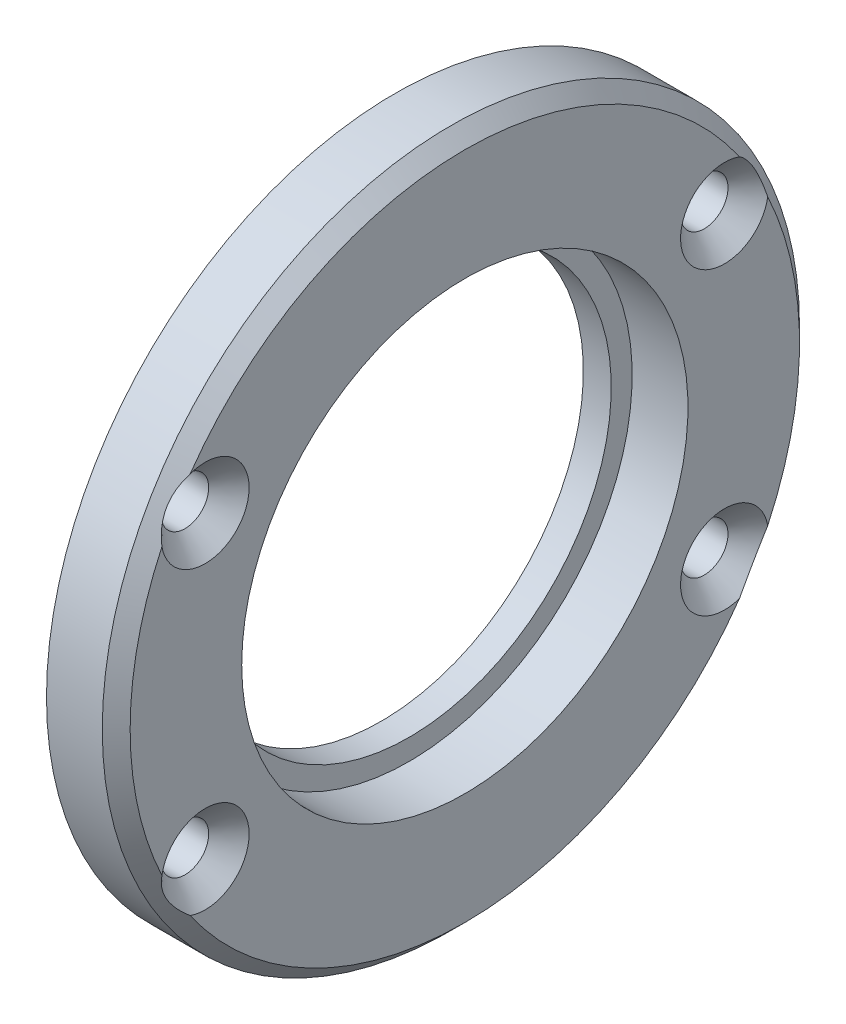
ISO-10303-21;
HEADER;
FILE_DESCRIPTION(('STEP AP214'),'2;1');
FILE_NAME('part.step','',(''),(''),'','','');
FILE_SCHEMA(('AUTOMOTIVE_DESIGN { 1 0 10303 214 1 1 1 1 }'));
ENDSEC;
DATA;
#1=APPLICATION_CONTEXT('core data for automotive mechanical design processes');
#2=APPLICATION_PROTOCOL_DEFINITION('international standard','automotive_design',2000,#1);
#3=PRODUCT_CONTEXT('',#1,'mechanical');
#4=PRODUCT('Part','Part','',(#3));
#5=PRODUCT_RELATED_PRODUCT_CATEGORY('part','',(#4));
#6=PRODUCT_DEFINITION_FORMATION('','',#4);
#7=PRODUCT_DEFINITION_CONTEXT('part definition',#1,'design');
#8=PRODUCT_DEFINITION('design','',#6,#7);
#9=PRODUCT_DEFINITION_SHAPE('','',#8);
#10=(LENGTH_UNIT() NAMED_UNIT(*) SI_UNIT(.MILLI.,.METRE.));
#11=(NAMED_UNIT(*) PLANE_ANGLE_UNIT() SI_UNIT($,.RADIAN.));
#12=(NAMED_UNIT(*) SI_UNIT($,.STERADIAN.) SOLID_ANGLE_UNIT());
#13=UNCERTAINTY_MEASURE_WITH_UNIT(LENGTH_MEASURE(1.E-05),#10,'distance_accuracy_value','');
#14=(GEOMETRIC_REPRESENTATION_CONTEXT(3) GLOBAL_UNCERTAINTY_ASSIGNED_CONTEXT((#13)) GLOBAL_UNIT_ASSIGNED_CONTEXT((#10,
#11,#12)) REPRESENTATION_CONTEXT('',''));
#15=CARTESIAN_POINT('',(0.,0.,0.));
#16=DIRECTION('',(0.,0.,1.));
#17=DIRECTION('',(1.,0.,0.));
#18=AXIS2_PLACEMENT_3D('',#15,#16,#17);
#19=CARTESIAN_POINT('',(-18.5380469099545,0.,0.));
#20=DIRECTION('',(-1.,0.,0.));
#21=DIRECTION('',(0.,0.,1.));
#22=AXIS2_PLACEMENT_3D('',#19,#20,#21);
#23=CYLINDRICAL_SURFACE('',#22,16.7);
#24=CARTESIAN_POINT('',(4.,0.,0.));
#25=DIRECTION('',(-1.,0.,0.));
#26=DIRECTION('',(0.,0.,1.));
#27=AXIS2_PLACEMENT_3D('',#24,#25,#26);
#28=CIRCLE('',#27,16.7);
#29=CARTESIAN_POINT('',(4.,0.,16.7));
#30=VERTEX_POINT('',#29);
#31=EDGE_CURVE('E182',#30,#30,#28,.T.);
#32=ORIENTED_EDGE('',*,*,#31,.F.);
#33=EDGE_LOOP('',(#32));
#34=FACE_BOUND('',#33,.T.);
#35=CARTESIAN_POINT('',(3.,0.,0.));
#36=DIRECTION('',(-1.,0.,0.));
#37=DIRECTION('',(0.,0.,1.));
#38=AXIS2_PLACEMENT_3D('',#35,#36,#37);
#39=CIRCLE('',#38,16.7);
#40=CARTESIAN_POINT('',(3.,0.,16.7));
#41=VERTEX_POINT('',#40);
#42=EDGE_CURVE('E165',#41,#41,#39,.T.);
#43=ORIENTED_EDGE('',*,*,#42,.T.);
#44=EDGE_LOOP('',(#43));
#45=FACE_BOUND('',#44,.T.);
#46=ADVANCED_FACE('F41',(#34,#45),#23,.F.);
#47=CARTESIAN_POINT('',(3.,19.,0.));
#48=DIRECTION('',(1.,0.,0.));
#49=DIRECTION('',(0.,0.,-1.));
#50=AXIS2_PLACEMENT_3D('',#47,#48,#49);
#51=PLANE('',#50);
#52=ORIENTED_EDGE('',*,*,#42,.F.);
#53=EDGE_LOOP('',(#52));
#54=FACE_BOUND('',#53,.T.);
#55=CARTESIAN_POINT('',(3.,0.,0.));
#56=DIRECTION('',(-1.,0.,0.));
#57=DIRECTION('',(0.,0.,1.));
#58=AXIS2_PLACEMENT_3D('',#55,#56,#57);
#59=CIRCLE('',#58,19.);
#60=CARTESIAN_POINT('',(3.,0.,19.));
#61=VERTEX_POINT('',#60);
#62=EDGE_CURVE('E186',#61,#61,#59,.T.);
#63=ORIENTED_EDGE('',*,*,#62,.T.);
#64=EDGE_LOOP('',(#63));
#65=FACE_BOUND('',#64,.T.);
#66=ADVANCED_FACE('F250',(#54,#65),#51,.F.);
#67=CARTESIAN_POINT('',(-18.5380469099545,0.,0.));
#68=DIRECTION('',(-1.,0.,0.));
#69=DIRECTION('',(0.,0.,1.));
#70=AXIS2_PLACEMENT_3D('',#67,#68,#69);
#71=CYLINDRICAL_SURFACE('',#70,19.);
#72=ORIENTED_EDGE('',*,*,#62,.F.);
#73=EDGE_LOOP('',(#72));
#74=FACE_BOUND('',#73,.T.);
#75=CARTESIAN_POINT('',(5.,0.,0.));
#76=DIRECTION('',(-1.,0.,0.));
#77=DIRECTION('',(0.,0.,1.));
#78=AXIS2_PLACEMENT_3D('',#75,#76,#77);
#79=CIRCLE('',#78,19.);
#80=CARTESIAN_POINT('',(5.,0.,19.));
#81=VERTEX_POINT('',#80);
#82=EDGE_CURVE('E189',#81,#81,#79,.T.);
#83=ORIENTED_EDGE('',*,*,#82,.T.);
#84=EDGE_LOOP('',(#83));
#85=FACE_BOUND('',#84,.T.);
#86=ADVANCED_FACE('F228',(#74,#85),#71,.T.);
#87=CARTESIAN_POINT('',(5.,25.,0.));
#88=DIRECTION('',(1.,0.,0.));
#89=DIRECTION('',(0.,0.,-1.));
#90=AXIS2_PLACEMENT_3D('',#87,#88,#89);
#91=PLANE('',#90);
#92=CARTESIAN_POINT('',(5.,-10.75,18.6195461813654));
#93=DIRECTION('',(1.,0.,0.));
#94=DIRECTION('',(0.,0.,-1.));
#95=AXIS2_PLACEMENT_3D('',#92,#93,#94);
#96=CIRCLE('',#95,1.69999999999999);
#97=CARTESIAN_POINT('',(5.,-10.75,16.9195461813654));
#98=VERTEX_POINT('',#97);
#99=EDGE_CURVE('E166',#98,#98,#96,.T.);
#100=ORIENTED_EDGE('',*,*,#99,.T.);
#101=EDGE_LOOP('',(#100));
#102=FACE_BOUND('',#101,.T.);
#103=CARTESIAN_POINT('',(5.,10.75,18.6195461813654));
#104=DIRECTION('',(1.,0.,0.));
#105=DIRECTION('',(0.,0.,-1.));
#106=AXIS2_PLACEMENT_3D('',#103,#104,#105);
#107=CIRCLE('',#106,1.69999999999999);
#108=CARTESIAN_POINT('',(5.,10.75,16.9195461813654));
#109=VERTEX_POINT('',#108);
#110=EDGE_CURVE('E169',#109,#109,#107,.T.);
#111=ORIENTED_EDGE('',*,*,#110,.T.);
#112=EDGE_LOOP('',(#111));
#113=FACE_BOUND('',#112,.T.);
#114=CARTESIAN_POINT('',(5.,-10.75,-18.6195461813654));
#115=DIRECTION('',(1.,0.,0.));
#116=DIRECTION('',(0.,0.,-1.));
#117=AXIS2_PLACEMENT_3D('',#114,#115,#116);
#118=CIRCLE('',#117,1.69999999999999);
#119=CARTESIAN_POINT('',(5.,-10.75,-20.3195461813654));
#120=VERTEX_POINT('',#119);
#121=EDGE_CURVE('E174',#120,#120,#118,.T.);
#122=ORIENTED_EDGE('',*,*,#121,.T.);
#123=EDGE_LOOP('',(#122));
#124=FACE_BOUND('',#123,.T.);
#125=CARTESIAN_POINT('',(5.,10.75,-18.6195461813654));
#126=DIRECTION('',(1.,0.,0.));
#127=DIRECTION('',(0.,0.,-1.));
#128=AXIS2_PLACEMENT_3D('',#125,#126,#127);
#129=CIRCLE('',#128,1.69999999999999);
#130=CARTESIAN_POINT('',(5.,10.75,-20.3195461813654));
#131=VERTEX_POINT('',#130);
#132=EDGE_CURVE('E179',#131,#131,#129,.T.);
#133=ORIENTED_EDGE('',*,*,#132,.T.);
#134=EDGE_LOOP('',(#133));
#135=FACE_BOUND('',#134,.T.);
#136=ORIENTED_EDGE('',*,*,#82,.F.);
#137=EDGE_LOOP('',(#136));
#138=FACE_BOUND('',#137,.T.);
#139=CARTESIAN_POINT('',(5.,0.,0.));
#140=DIRECTION('',(-1.,0.,0.));
#141=DIRECTION('',(0.,0.,1.));
#142=AXIS2_PLACEMENT_3D('',#139,#140,#141);
#143=CIRCLE('',#142,25.);
#144=CARTESIAN_POINT('',(5.,0.,25.));
#145=VERTEX_POINT('',#144);
#146=EDGE_CURVE('E192',#145,#145,#143,.T.);
#147=ORIENTED_EDGE('',*,*,#146,.T.);
#148=EDGE_LOOP('',(#147));
#149=FACE_BOUND('',#148,.T.);
#150=ADVANCED_FACE('F224',(#102,#113,#124,#135,#138,#149),#91,.F.);
#151=CARTESIAN_POINT('',(-18.5380469099545,0.,0.));
#152=DIRECTION('',(-1.,0.,0.));
#153=DIRECTION('',(0.,0.,1.));
#154=AXIS2_PLACEMENT_3D('',#151,#152,#153);
#155=CYLINDRICAL_SURFACE('',#154,25.);
#156=CARTESIAN_POINT('',(8.99999999999999,0.,0.));
#157=DIRECTION('',(-1.,0.,0.));
#158=DIRECTION('',(0.,0.,1.));
#159=AXIS2_PLACEMENT_3D('',#156,#157,#158);
#160=CIRCLE('',#159,25.);
#161=CARTESIAN_POINT('',(8.99999999999999,0.,25.));
#162=VERTEX_POINT('',#161);
#163=EDGE_CURVE('E162',#162,#162,#160,.T.);
#164=ORIENTED_EDGE('',*,*,#163,.T.);
#165=EDGE_LOOP('',(#164));
#166=FACE_BOUND('',#165,.T.);
#167=ORIENTED_EDGE('',*,*,#146,.F.);
#168=EDGE_LOOP('',(#167));
#169=FACE_BOUND('',#168,.T.);
#170=ADVANCED_FACE('F227',(#166,#169),#155,.T.);
#171=CARTESIAN_POINT('',(10.,16.,0.));
#172=DIRECTION('',(-1.,0.,0.));
#173=DIRECTION('',(0.,0.,1.));
#174=AXIS2_PLACEMENT_3D('',#171,#172,#173);
#175=PLANE('',#174);
#176=CARTESIAN_POINT('',(10.,-10.75,-18.6195461813654));
#177=DIRECTION('',(1.,0.,0.));
#178=DIRECTION('',(0.,0.,-1.));
#179=AXIS2_PLACEMENT_3D('',#176,#177,#178);
#180=CIRCLE('',#179,3.15);
#181=CARTESIAN_POINT('',(10.,-10.2053888659361,-21.7221094301411));
#182=VERTEX_POINT('',#181);
#183=CARTESIAN_POINT('',(10.,-13.7092041573197,-19.6991807284701));
#184=VERTEX_POINT('',#183);
#185=EDGE_CURVE('E172',#182,#184,#180,.T.);
#186=ORIENTED_EDGE('',*,*,#185,.F.);
#187=CARTESIAN_POINT('',(10.,0.,0.));
#188=DIRECTION('',(-1.,0.,0.));
#189=DIRECTION('',(0.,0.,1.));
#190=AXIS2_PLACEMENT_3D('',#187,#188,#189);
#191=CIRCLE('',#190,24.);
#192=CARTESIAN_POINT('',(10.,10.2053888659361,-21.7221094301411));
#193=VERTEX_POINT('',#192);
#194=EDGE_CURVE('E158',#182,#193,#191,.F.);
#195=ORIENTED_EDGE('',*,*,#194,.T.);
#196=CARTESIAN_POINT('',(10.,10.75,-18.6195461813654));
#197=DIRECTION('',(1.,0.,0.));
#198=DIRECTION('',(0.,0.,-1.));
#199=AXIS2_PLACEMENT_3D('',#196,#197,#198);
#200=CIRCLE('',#199,3.15);
#201=CARTESIAN_POINT('',(10.,13.7092041573197,-19.6991807284701));
#202=VERTEX_POINT('',#201);
#203=EDGE_CURVE('E177',#202,#193,#200,.T.);
#204=ORIENTED_EDGE('',*,*,#203,.F.);
#205=CARTESIAN_POINT('',(10.,0.,0.));
#206=DIRECTION('',(-1.,0.,0.));
#207=DIRECTION('',(0.,0.,1.));
#208=AXIS2_PLACEMENT_3D('',#205,#206,#207);
#209=CIRCLE('',#208,24.);
#210=CARTESIAN_POINT('',(10.,13.7092041573197,19.6991807284701));
#211=VERTEX_POINT('',#210);
#212=EDGE_CURVE('E100',#202,#211,#209,.F.);
#213=ORIENTED_EDGE('',*,*,#212,.T.);
#214=CARTESIAN_POINT('',(10.,10.75,18.6195461813654));
#215=DIRECTION('',(1.,0.,0.));
#216=DIRECTION('',(0.,0.,-1.));
#217=AXIS2_PLACEMENT_3D('',#214,#215,#216);
#218=CIRCLE('',#217,3.15);
#219=CARTESIAN_POINT('',(10.,10.2053888659361,21.7221094301411));
#220=VERTEX_POINT('',#219);
#221=EDGE_CURVE('E97',#220,#211,#218,.T.);
#222=ORIENTED_EDGE('',*,*,#221,.F.);
#223=CARTESIAN_POINT('',(10.,0.,0.));
#224=DIRECTION('',(-1.,0.,0.));
#225=DIRECTION('',(0.,0.,1.));
#226=AXIS2_PLACEMENT_3D('',#223,#224,#225);
#227=CIRCLE('',#226,24.);
#228=CARTESIAN_POINT('',(10.,-10.2053888659361,21.7221094301411));
#229=VERTEX_POINT('',#228);
#230=EDGE_CURVE('E89',#220,#229,#227,.F.);
#231=ORIENTED_EDGE('',*,*,#230,.T.);
#232=CARTESIAN_POINT('',(10.,-10.75,18.6195461813654));
#233=DIRECTION('',(1.,0.,0.));
#234=DIRECTION('',(0.,0.,-1.));
#235=AXIS2_PLACEMENT_3D('',#232,#233,#234);
#236=CIRCLE('',#235,3.15);
#237=CARTESIAN_POINT('',(10.,-13.7092041573197,19.6991807284701));
#238=VERTEX_POINT('',#237);
#239=EDGE_CURVE('E94',#238,#229,#236,.T.);
#240=ORIENTED_EDGE('',*,*,#239,.F.);
#241=CARTESIAN_POINT('',(10.,0.,0.));
#242=DIRECTION('',(-1.,0.,0.));
#243=DIRECTION('',(0.,0.,1.));
#244=AXIS2_PLACEMENT_3D('',#241,#242,#243);
#245=CIRCLE('',#244,24.);
#246=EDGE_CURVE('E101',#238,#184,#245,.F.);
#247=ORIENTED_EDGE('',*,*,#246,.T.);
#248=EDGE_LOOP('',(#186,#195,#204,#213,#222,#231,#240,#247));
#249=FACE_BOUND('',#248,.T.);
#250=CARTESIAN_POINT('',(10.,0.,0.));
#251=DIRECTION('',(-1.,0.,0.));
#252=DIRECTION('',(0.,0.,1.));
#253=AXIS2_PLACEMENT_3D('',#250,#251,#252);
#254=CIRCLE('',#253,16.);
#255=CARTESIAN_POINT('',(10.,0.,16.));
#256=VERTEX_POINT('',#255);
#257=EDGE_CURVE('E195',#256,#256,#254,.T.);
#258=ORIENTED_EDGE('',*,*,#257,.T.);
#259=EDGE_LOOP('',(#258));
#260=FACE_BOUND('',#259,.T.);
#261=ADVANCED_FACE('F92',(#249,#260),#175,.F.);
#262=CARTESIAN_POINT('',(-18.5380469099545,0.,0.));
#263=DIRECTION('',(-1.,0.,0.));
#264=DIRECTION('',(0.,0.,1.));
#265=AXIS2_PLACEMENT_3D('',#262,#263,#264);
#266=CYLINDRICAL_SURFACE('',#265,16.);
#267=ORIENTED_EDGE('',*,*,#257,.F.);
#268=EDGE_LOOP('',(#267));
#269=FACE_BOUND('',#268,.T.);
#270=CARTESIAN_POINT('',(6.,0.,0.));
#271=DIRECTION('',(-1.,0.,0.));
#272=DIRECTION('',(0.,0.,1.));
#273=AXIS2_PLACEMENT_3D('',#270,#271,#272);
#274=CIRCLE('',#273,16.);
#275=CARTESIAN_POINT('',(6.,0.,16.));
#276=VERTEX_POINT('',#275);
#277=EDGE_CURVE('E198',#276,#276,#274,.T.);
#278=ORIENTED_EDGE('',*,*,#277,.T.);
#279=EDGE_LOOP('',(#278));
#280=FACE_BOUND('',#279,.T.);
#281=ADVANCED_FACE('F247',(#269,#280),#266,.F.);
#282=CARTESIAN_POINT('',(6.,14.5,0.));
#283=DIRECTION('',(-1.,0.,0.));
#284=DIRECTION('',(0.,0.,1.));
#285=AXIS2_PLACEMENT_3D('',#282,#283,#284);
#286=PLANE('',#285);
#287=ORIENTED_EDGE('',*,*,#277,.F.);
#288=EDGE_LOOP('',(#287));
#289=FACE_BOUND('',#288,.T.);
#290=CARTESIAN_POINT('',(6.,0.,0.));
#291=DIRECTION('',(-1.,0.,0.));
#292=DIRECTION('',(0.,0.,1.));
#293=AXIS2_PLACEMENT_3D('',#290,#291,#292);
#294=CIRCLE('',#293,14.5);
#295=CARTESIAN_POINT('',(6.,0.,14.5));
#296=VERTEX_POINT('',#295);
#297=EDGE_CURVE('E201',#296,#296,#294,.T.);
#298=ORIENTED_EDGE('',*,*,#297,.T.);
#299=EDGE_LOOP('',(#298));
#300=FACE_BOUND('',#299,.T.);
#301=ADVANCED_FACE('F325',(#289,#300),#286,.F.);
#302=CARTESIAN_POINT('',(-18.5380469099545,0.,0.));
#303=DIRECTION('',(-1.,0.,0.));
#304=DIRECTION('',(0.,0.,1.));
#305=AXIS2_PLACEMENT_3D('',#302,#303,#304);
#306=CYLINDRICAL_SURFACE('',#305,14.5);
#307=ORIENTED_EDGE('',*,*,#297,.F.);
#308=EDGE_LOOP('',(#307));
#309=FACE_BOUND('',#308,.T.);
#310=CARTESIAN_POINT('',(4.,0.,0.));
#311=DIRECTION('',(-1.,0.,0.));
#312=DIRECTION('',(0.,0.,1.));
#313=AXIS2_PLACEMENT_3D('',#310,#311,#312);
#314=CIRCLE('',#313,14.5);
#315=CARTESIAN_POINT('',(4.,0.,14.5));
#316=VERTEX_POINT('',#315);
#317=EDGE_CURVE('E204',#316,#316,#314,.T.);
#318=ORIENTED_EDGE('',*,*,#317,.T.);
#319=EDGE_LOOP('',(#318));
#320=FACE_BOUND('',#319,.T.);
#321=ADVANCED_FACE('F318',(#309,#320),#306,.F.);
#322=CARTESIAN_POINT('',(4.,16.7,0.));
#323=DIRECTION('',(1.,0.,0.));
#324=DIRECTION('',(0.,0.,-1.));
#325=AXIS2_PLACEMENT_3D('',#322,#323,#324);
#326=PLANE('',#325);
#327=ORIENTED_EDGE('',*,*,#317,.F.);
#328=EDGE_LOOP('',(#327));
#329=FACE_BOUND('',#328,.T.);
#330=ORIENTED_EDGE('',*,*,#31,.T.);
#331=EDGE_LOOP('',(#330));
#332=FACE_BOUND('',#331,.T.);
#333=ADVANCED_FACE('F306',(#329,#332),#326,.F.);
#334=CARTESIAN_POINT('',(10.,10.75,-18.6195461813654));
#335=DIRECTION('',(1.,0.,0.));
#336=DIRECTION('',(0.,0.,-1.));
#337=AXIS2_PLACEMENT_3D('',#334,#335,#336);
#338=CYLINDRICAL_SURFACE('',#337,1.69999999999999);
#339=CARTESIAN_POINT('',(8.55,10.75,-18.6195461813654));
#340=DIRECTION('',(1.,0.,0.));
#341=DIRECTION('',(0.,0.,-1.));
#342=AXIS2_PLACEMENT_3D('',#339,#340,#341);
#343=CIRCLE('',#342,1.7);
#344=CARTESIAN_POINT('',(8.55,10.75,-20.3195461813654));
#345=VERTEX_POINT('',#344);
#346=EDGE_CURVE('E183',#345,#345,#343,.T.);
#347=ORIENTED_EDGE('',*,*,#346,.T.);
#348=EDGE_LOOP('',(#347));
#349=FACE_BOUND('',#348,.T.);
#350=ORIENTED_EDGE('',*,*,#132,.F.);
#351=EDGE_LOOP('',(#350));
#352=FACE_BOUND('',#351,.T.);
#353=ADVANCED_FACE('F150',(#349,#352),#338,.F.);
#354=CARTESIAN_POINT('',(10.,10.75,-18.6195461813654));
#355=DIRECTION('',(1.,0.,0.));
#356=DIRECTION('',(0.,0.,-1.));
#357=AXIS2_PLACEMENT_3D('',#354,#355,#356);
#358=CONICAL_SURFACE('',#357,3.15,0.785398163397448);
#359=ORIENTED_EDGE('',*,*,#346,.F.);
#360=EDGE_LOOP('',(#359));
#361=FACE_BOUND('',#360,.T.);
#362=ORIENTED_EDGE('',*,*,#203,.T.);
#363=CARTESIAN_POINT('',(10.,10.2053888659361,-21.7221094301411));
#364=CARTESIAN_POINT('',(9.96137893093603,10.3322220353334,-21.7051973885753));
#365=CARTESIAN_POINT('',(9.92558434170605,10.4594197389709,-21.6839534650089));
#366=CARTESIAN_POINT('',(9.86032695773192,10.7137540384085,-21.6322682231893));
#367=CARTESIAN_POINT('',(9.83087303307783,10.8408903035271,-21.6018141619765));
#368=CARTESIAN_POINT('',(9.7791817526919,11.0934916227394,-21.5313481093338));
#369=CARTESIAN_POINT('',(9.75691844228903,11.2189610836803,-21.4913714192849));
#370=CARTESIAN_POINT('',(9.72009811546861,11.4674380157169,-21.401602574799));
#371=CARTESIAN_POINT('',(9.70553685266528,11.5904468073868,-21.3518158497749));
#372=CARTESIAN_POINT('',(9.6850469203442,11.8271265560754,-21.2450460275224));
#373=CARTESIAN_POINT('',(9.67874727508782,11.9409654421574,-21.1885069128577));
#374=CARTESIAN_POINT('',(9.67373692314066,12.1642068135913,-21.0669242671037));
#375=CARTESIAN_POINT('',(9.6750273336381,12.2736086434619,-21.0018794854342));
#376=CARTESIAN_POINT('',(9.68516105290433,12.4869289732004,-20.8639425025584));
#377=CARTESIAN_POINT('',(9.69400191305707,12.5908492391439,-20.7910528521454));
#378=CARTESIAN_POINT('',(9.71895932457139,12.79241793267,-20.6382855854083));
#379=CARTESIAN_POINT('',(9.7350743495482,12.89006767113,-20.5584094379395));
#380=CARTESIAN_POINT('',(9.78263946636469,13.1195338436508,-20.3565702395189));
#381=CARTESIAN_POINT('',(9.81770919876945,13.2478012953969,-20.231378233314));
#382=CARTESIAN_POINT('',(9.87952402815491,13.429087565992,-20.0365775657071));
#383=CARTESIAN_POINT('',(9.90165326096098,13.4876425207478,-19.9705032144689));
#384=CARTESIAN_POINT('',(9.94875211098999,13.6011235726555,-19.8363079412898));
#385=CARTESIAN_POINT('',(9.9737210612539,13.6560505171403,-19.7681875026643));
#386=CARTESIAN_POINT('',(10.,13.7092041573197,-19.6991807284701));
#387=B_SPLINE_CURVE_WITH_KNOTS('',3,(#363,#364,#365,#366,#367,#368,#369,#370,#371,#372,#373,
#374,#375,#376,#377,#378,#379,#380,#381,#382,#383,#384,#385,#386),.UNSPECIFIED.,.F.,.F.,(4,2,2,
2,2,2,2,2,2,2,2,4),(0.,0.400988493408088,0.802534344423923,1.20261417488833,1.60247319799273,
1.98368133675945,2.36494558735325,2.74608624061704,3.12714695383895,3.67347055589679,
3.94641290646711,4.21929128346105),.UNSPECIFIED.);
#388=EDGE_CURVE('E63',#193,#202,#387,.T.);
#389=ORIENTED_EDGE('',*,*,#388,.T.);
#390=EDGE_LOOP('',(#362,#389));
#391=FACE_BOUND('',#390,.T.);
#392=ADVANCED_FACE('F145',(#361,#391),#358,.F.);
#393=CARTESIAN_POINT('',(10.,-10.75,-18.6195461813654));
#394=DIRECTION('',(1.,0.,0.));
#395=DIRECTION('',(0.,0.,-1.));
#396=AXIS2_PLACEMENT_3D('',#393,#394,#395);
#397=CYLINDRICAL_SURFACE('',#396,1.69999999999999);
#398=CARTESIAN_POINT('',(8.55,-10.75,-18.6195461813654));
#399=DIRECTION('',(1.,0.,0.));
#400=DIRECTION('',(0.,0.,-1.));
#401=AXIS2_PLACEMENT_3D('',#398,#399,#400);
#402=CIRCLE('',#401,1.7);
#403=CARTESIAN_POINT('',(8.55,-10.75,-20.3195461813654));
#404=VERTEX_POINT('',#403);
#405=EDGE_CURVE('E178',#404,#404,#402,.T.);
#406=ORIENTED_EDGE('',*,*,#405,.T.);
#407=EDGE_LOOP('',(#406));
#408=FACE_BOUND('',#407,.T.);
#409=ORIENTED_EDGE('',*,*,#121,.F.);
#410=EDGE_LOOP('',(#409));
#411=FACE_BOUND('',#410,.T.);
#412=ADVANCED_FACE('F141',(#408,#411),#397,.F.);
#413=CARTESIAN_POINT('',(10.,-10.75,-18.6195461813654));
#414=DIRECTION('',(1.,0.,0.));
#415=DIRECTION('',(0.,0.,-1.));
#416=AXIS2_PLACEMENT_3D('',#413,#414,#415);
#417=CONICAL_SURFACE('',#416,3.15,0.785398163397448);
#418=ORIENTED_EDGE('',*,*,#405,.F.);
#419=EDGE_LOOP('',(#418));
#420=FACE_BOUND('',#419,.T.);
#421=ORIENTED_EDGE('',*,*,#185,.T.);
#422=CARTESIAN_POINT('',(10.,-13.7092041573197,-19.6991807284701));
#423=CARTESIAN_POINT('',(9.96137893093603,-13.6311413149952,-19.8005654544277));
#424=CARTESIAN_POINT('',(9.92558434170605,-13.5491446856919,-19.9000999352976));
#425=CARTESIAN_POINT('',(9.86032695773192,-13.3772168035565,-20.0945172787545));
#426=CARTESIAN_POINT('',(9.83087303307783,-13.2872746803386,-20.1893934834831));
#427=CARTESIAN_POINT('',(9.7791817526919,-13.0999486290394,-20.372919616629));
#428=CARTESIAN_POINT('',(9.75691844228904,-13.0025930694274,-20.4615910121785));
#429=CARTESIAN_POINT('',(9.72009811546861,-12.800612503616,-20.6318939253337));
#430=CARTESIAN_POINT('',(9.70553685266528,-12.6959915391389,-20.7135293012966));
#431=CARTESIAN_POINT('',(9.6850469203442,-12.4851862863664,-20.865115065096));
#432=CARTESIAN_POINT('',(9.67874727508782,-12.3793025337183,-20.9354328750492));
#433=CARTESIAN_POINT('',(9.67373692314066,-12.1623881881191,-21.0679742510096));
#434=CARTESIAN_POINT('',(9.6750273336381,-12.0513568398744,-21.1301966240633));
#435=CARTESIAN_POINT('',(9.68516105290433,-11.8252397437133,-21.2459689573227));
#436=CARTESIAN_POINT('',(9.69400191305707,-11.7101553218109,-21.2995217223912));
#437=CARTESIAN_POINT('',(9.71895932457139,-11.4770706411869,-21.397701698224));
#438=CARTESIAN_POINT('',(9.7350743495482,-11.3590709990924,-21.4423307786688));
#439=CARTESIAN_POINT('',(9.78263946636469,-11.0695400395203,-21.5401347141707));
#440=CARTESIAN_POINT('',(9.81770919876945,-10.8969868559231,-21.5886215827591));
#441=CARTESIAN_POINT('',(9.87952402815491,-10.6376413938038,-21.6482197646484));
#442=CARTESIAN_POINT('',(9.90165326096098,-10.551141849715,-21.6658926673652));
#443=CARTESIAN_POINT('',(9.94875211098999,-10.3781848081203,-21.6970725045759));
#444=CARTESIAN_POINT('',(9.9737210612539,-10.2917273055113,-21.7105804145392));
#445=CARTESIAN_POINT('',(10.,-10.2053888659361,-21.7221094301411));
#446=B_SPLINE_CURVE_WITH_KNOTS('',3,(#422,#423,#424,#425,#426,#427,#428,#429,#430,#431,#432,
#433,#434,#435,#436,#437,#438,#439,#440,#441,#442,#443,#444,#445),.UNSPECIFIED.,.F.,.F.,(4,2,2,
2,2,2,2,2,2,2,2,4),(0.,0.400988493408088,0.802534344423924,1.20261417488832,1.60247319799273,
1.98368133675945,2.36494558735325,2.74608624061705,3.12714695383896,3.67347055589679,
3.94641290646711,4.21929128346105),.UNSPECIFIED.);
#447=EDGE_CURVE('E11',#184,#182,#446,.T.);
#448=ORIENTED_EDGE('',*,*,#447,.T.);
#449=EDGE_LOOP('',(#421,#448));
#450=FACE_BOUND('',#449,.T.);
#451=ADVANCED_FACE('F136',(#420,#450),#417,.F.);
#452=CARTESIAN_POINT('',(10.,10.75,18.6195461813654));
#453=DIRECTION('',(1.,0.,0.));
#454=DIRECTION('',(0.,0.,-1.));
#455=AXIS2_PLACEMENT_3D('',#452,#453,#454);
#456=CYLINDRICAL_SURFACE('',#455,1.69999999999999);
#457=CARTESIAN_POINT('',(8.55,10.75,18.6195461813654));
#458=DIRECTION('',(1.,0.,0.));
#459=DIRECTION('',(0.,0.,-1.));
#460=AXIS2_PLACEMENT_3D('',#457,#458,#459);
#461=CIRCLE('',#460,1.7);
#462=CARTESIAN_POINT('',(8.55,10.75,16.9195461813654));
#463=VERTEX_POINT('',#462);
#464=EDGE_CURVE('E173',#463,#463,#461,.T.);
#465=ORIENTED_EDGE('',*,*,#464,.T.);
#466=EDGE_LOOP('',(#465));
#467=FACE_BOUND('',#466,.T.);
#468=ORIENTED_EDGE('',*,*,#110,.F.);
#469=EDGE_LOOP('',(#468));
#470=FACE_BOUND('',#469,.T.);
#471=ADVANCED_FACE('F133',(#467,#470),#456,.F.);
#472=CARTESIAN_POINT('',(10.,10.75,18.6195461813654));
#473=DIRECTION('',(1.,0.,0.));
#474=DIRECTION('',(0.,0.,-1.));
#475=AXIS2_PLACEMENT_3D('',#472,#473,#474);
#476=CONICAL_SURFACE('',#475,3.15,0.785398163397448);
#477=ORIENTED_EDGE('',*,*,#464,.F.);
#478=EDGE_LOOP('',(#477));
#479=FACE_BOUND('',#478,.T.);
#480=ORIENTED_EDGE('',*,*,#221,.T.);
#481=CARTESIAN_POINT('',(10.,13.7092041573197,19.6991807284701));
#482=CARTESIAN_POINT('',(9.96137893093603,13.6311413149952,19.8005654544277));
#483=CARTESIAN_POINT('',(9.92558434170605,13.5491446856919,19.9000999352976));
#484=CARTESIAN_POINT('',(9.86032695773192,13.3772168035565,20.0945172787545));
#485=CARTESIAN_POINT('',(9.83087303307783,13.2872746803386,20.1893934834831));
#486=CARTESIAN_POINT('',(9.7791817526919,13.0999486290394,20.372919616629));
#487=CARTESIAN_POINT('',(9.75691844228904,13.0025930694274,20.4615910121785));
#488=CARTESIAN_POINT('',(9.72009811546861,12.800612503616,20.6318939253337));
#489=CARTESIAN_POINT('',(9.70553685266528,12.6959915391389,20.7135293012966));
#490=CARTESIAN_POINT('',(9.6850469203442,12.4851862863664,20.865115065096));
#491=CARTESIAN_POINT('',(9.67874727508782,12.3793025337183,20.9354328750492));
#492=CARTESIAN_POINT('',(9.67373692314066,12.1623881881191,21.0679742510096));
#493=CARTESIAN_POINT('',(9.6750273336381,12.0513568398744,21.1301966240633));
#494=CARTESIAN_POINT('',(9.68516105290433,11.8252397437133,21.2459689573227));
#495=CARTESIAN_POINT('',(9.69400191305707,11.7101553218109,21.2995217223912));
#496=CARTESIAN_POINT('',(9.71895932457139,11.4770706411869,21.397701698224));
#497=CARTESIAN_POINT('',(9.7350743495482,11.3590709990924,21.4423307786688));
#498=CARTESIAN_POINT('',(9.78263946636469,11.0695400395203,21.5401347141707));
#499=CARTESIAN_POINT('',(9.81770919876945,10.8969868559231,21.5886215827591));
#500=CARTESIAN_POINT('',(9.87952402815491,10.6376413938038,21.6482197646484));
#501=CARTESIAN_POINT('',(9.90165326096098,10.551141849715,21.6658926673652));
#502=CARTESIAN_POINT('',(9.94875211098999,10.3781848081203,21.6970725045759));
#503=CARTESIAN_POINT('',(9.9737210612539,10.2917273055113,21.7105804145392));
#504=CARTESIAN_POINT('',(10.,10.2053888659361,21.7221094301411));
#505=B_SPLINE_CURVE_WITH_KNOTS('',3,(#481,#482,#483,#484,#485,#486,#487,#488,#489,#490,#491,
#492,#493,#494,#495,#496,#497,#498,#499,#500,#501,#502,#503,#504),.UNSPECIFIED.,.F.,.F.,(4,2,2,
2,2,2,2,2,2,2,2,4),(0.,0.400988493408088,0.802534344423924,1.20261417488832,1.60247319799273,
1.98368133675945,2.36494558735325,2.74608624061705,3.12714695383896,3.67347055589679,
3.94641290646711,4.21929128346105),.UNSPECIFIED.);
#506=EDGE_CURVE('E109',#211,#220,#505,.T.);
#507=ORIENTED_EDGE('',*,*,#506,.T.);
#508=EDGE_LOOP('',(#480,#507));
#509=FACE_BOUND('',#508,.T.);
#510=ADVANCED_FACE('F128',(#479,#509),#476,.F.);
#511=CARTESIAN_POINT('',(10.,-10.75,18.6195461813654));
#512=DIRECTION('',(1.,0.,0.));
#513=DIRECTION('',(0.,0.,-1.));
#514=AXIS2_PLACEMENT_3D('',#511,#512,#513);
#515=CYLINDRICAL_SURFACE('',#514,1.69999999999999);
#516=CARTESIAN_POINT('',(8.55,-10.75,18.6195461813654));
#517=DIRECTION('',(1.,0.,0.));
#518=DIRECTION('',(0.,0.,-1.));
#519=AXIS2_PLACEMENT_3D('',#516,#517,#518);
#520=CIRCLE('',#519,1.7);
#521=CARTESIAN_POINT('',(8.55,-10.75,16.9195461813654));
#522=VERTEX_POINT('',#521);
#523=EDGE_CURVE('E105',#522,#522,#520,.T.);
#524=ORIENTED_EDGE('',*,*,#523,.T.);
#525=EDGE_LOOP('',(#524));
#526=FACE_BOUND('',#525,.T.);
#527=ORIENTED_EDGE('',*,*,#99,.F.);
#528=EDGE_LOOP('',(#527));
#529=FACE_BOUND('',#528,.T.);
#530=ADVANCED_FACE('F125',(#526,#529),#515,.F.);
#531=CARTESIAN_POINT('',(10.,-10.75,18.6195461813654));
#532=DIRECTION('',(1.,0.,0.));
#533=DIRECTION('',(0.,0.,-1.));
#534=AXIS2_PLACEMENT_3D('',#531,#532,#533);
#535=CONICAL_SURFACE('',#534,3.15,0.785398163397448);
#536=ORIENTED_EDGE('',*,*,#523,.F.);
#537=EDGE_LOOP('',(#536));
#538=FACE_BOUND('',#537,.T.);
#539=ORIENTED_EDGE('',*,*,#239,.T.);
#540=CARTESIAN_POINT('',(10.,-10.2053888659361,21.7221094301411));
#541=CARTESIAN_POINT('',(9.96137893093603,-10.3322220353334,21.7051973885753));
#542=CARTESIAN_POINT('',(9.92558434170605,-10.4594197389709,21.6839534650089));
#543=CARTESIAN_POINT('',(9.86032695773192,-10.7137540384085,21.6322682231893));
#544=CARTESIAN_POINT('',(9.83087303307783,-10.8408903035271,21.6018141619765));
#545=CARTESIAN_POINT('',(9.7791817526919,-11.0934916227394,21.5313481093338));
#546=CARTESIAN_POINT('',(9.75691844228903,-11.2189610836803,21.4913714192849));
#547=CARTESIAN_POINT('',(9.72009811546861,-11.4674380157169,21.401602574799));
#548=CARTESIAN_POINT('',(9.70553685266528,-11.5904468073868,21.3518158497749));
#549=CARTESIAN_POINT('',(9.6850469203442,-11.8271265560754,21.2450460275224));
#550=CARTESIAN_POINT('',(9.67874727508782,-11.9409654421574,21.1885069128577));
#551=CARTESIAN_POINT('',(9.67373692314066,-12.1642068135913,21.0669242671037));
#552=CARTESIAN_POINT('',(9.6750273336381,-12.2736086434619,21.0018794854342));
#553=CARTESIAN_POINT('',(9.68516105290433,-12.4869289732004,20.8639425025584));
#554=CARTESIAN_POINT('',(9.69400191305707,-12.5908492391439,20.7910528521454));
#555=CARTESIAN_POINT('',(9.71895932457139,-12.79241793267,20.6382855854083));
#556=CARTESIAN_POINT('',(9.7350743495482,-12.89006767113,20.5584094379395));
#557=CARTESIAN_POINT('',(9.78263946636469,-13.1195338436508,20.3565702395189));
#558=CARTESIAN_POINT('',(9.81770919876945,-13.2478012953969,20.231378233314));
#559=CARTESIAN_POINT('',(9.87952402815491,-13.429087565992,20.0365775657071));
#560=CARTESIAN_POINT('',(9.90165326096098,-13.4876425207478,19.9705032144689));
#561=CARTESIAN_POINT('',(9.94875211098999,-13.6011235726555,19.8363079412898));
#562=CARTESIAN_POINT('',(9.9737210612539,-13.6560505171403,19.7681875026643));
#563=CARTESIAN_POINT('',(10.,-13.7092041573197,19.6991807284701));
#564=B_SPLINE_CURVE_WITH_KNOTS('',3,(#540,#541,#542,#543,#544,#545,#546,#547,#548,#549,#550,
#551,#552,#553,#554,#555,#556,#557,#558,#559,#560,#561,#562,#563),.UNSPECIFIED.,.F.,.F.,(4,2,2,
2,2,2,2,2,2,2,2,4),(0.,0.400988493408088,0.802534344423923,1.20261417488833,1.60247319799273,
1.98368133675945,2.36494558735325,2.74608624061704,3.12714695383895,3.67347055589679,
3.94641290646711,4.21929128346105),.UNSPECIFIED.);
#565=EDGE_CURVE('E56',#229,#238,#564,.T.);
#566=ORIENTED_EDGE('',*,*,#565,.T.);
#567=EDGE_LOOP('',(#539,#566));
#568=FACE_BOUND('',#567,.T.);
#569=ADVANCED_FACE('F104',(#538,#568),#535,.F.);
#570=CARTESIAN_POINT('',(8.99999999999999,0.,0.));
#571=DIRECTION('',(-1.,0.,0.));
#572=DIRECTION('',(0.,0.,1.));
#573=AXIS2_PLACEMENT_3D('',#570,#571,#572);
#574=CONICAL_SURFACE('',#573,25.,0.785398163397452);
#575=ORIENTED_EDGE('',*,*,#388,.F.);
#576=ORIENTED_EDGE('',*,*,#194,.F.);
#577=ORIENTED_EDGE('',*,*,#447,.F.);
#578=ORIENTED_EDGE('',*,*,#246,.F.);
#579=ORIENTED_EDGE('',*,*,#565,.F.);
#580=ORIENTED_EDGE('',*,*,#230,.F.);
#581=ORIENTED_EDGE('',*,*,#506,.F.);
#582=ORIENTED_EDGE('',*,*,#212,.F.);
#583=EDGE_LOOP('',(#575,#576,#577,#578,#579,#580,#581,#582));
#584=FACE_BOUND('',#583,.T.);
#585=ORIENTED_EDGE('',*,*,#163,.F.);
#586=EDGE_LOOP('',(#585));
#587=FACE_BOUND('',#586,.T.);
#588=ADVANCED_FACE('F44',(#584,#587),#574,.T.);
#589=CLOSED_SHELL('',(#46,#66,#86,#150,#170,#261,#281,#301,#321,#333,#353,#392,#412,#451,#471,
#510,#530,#569,#588));
#590=MANIFOLD_SOLID_BREP('B2',#589);
#591=ADVANCED_BREP_SHAPE_REPRESENTATION('',(#18,#590),#14);
#592=SHAPE_DEFINITION_REPRESENTATION(#9,#591);
ENDSEC;
END-ISO-10303-21;
